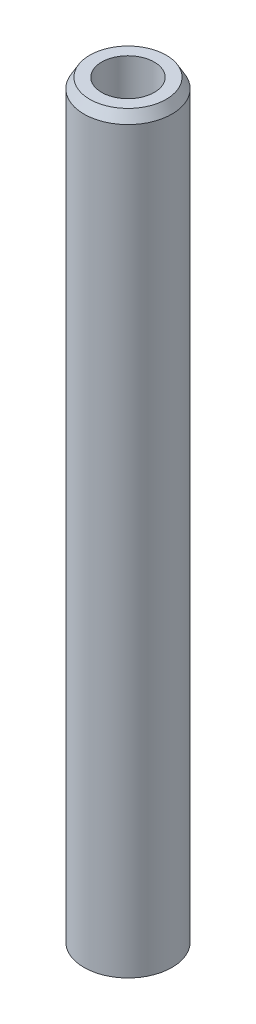
ISO-10303-21;
HEADER;
FILE_DESCRIPTION(('STEP AP214'),'2;1');
FILE_NAME('part.step','',(''),(''),'','','');
FILE_SCHEMA(('AUTOMOTIVE_DESIGN { 1 0 10303 214 1 1 1 1 }'));
ENDSEC;
DATA;
#1=APPLICATION_CONTEXT('core data for automotive mechanical design processes');
#2=APPLICATION_PROTOCOL_DEFINITION('international standard','automotive_design',2000,#1);
#3=PRODUCT_CONTEXT('',#1,'mechanical');
#4=PRODUCT('Part','Part','',(#3));
#5=PRODUCT_RELATED_PRODUCT_CATEGORY('part','',(#4));
#6=PRODUCT_DEFINITION_FORMATION('','',#4);
#7=PRODUCT_DEFINITION_CONTEXT('part definition',#1,'design');
#8=PRODUCT_DEFINITION('design','',#6,#7);
#9=PRODUCT_DEFINITION_SHAPE('','',#8);
#10=(LENGTH_UNIT() NAMED_UNIT(*) SI_UNIT(.MILLI.,.METRE.));
#11=(NAMED_UNIT(*) PLANE_ANGLE_UNIT() SI_UNIT($,.RADIAN.));
#12=(NAMED_UNIT(*) SI_UNIT($,.STERADIAN.) SOLID_ANGLE_UNIT());
#13=UNCERTAINTY_MEASURE_WITH_UNIT(LENGTH_MEASURE(1.E-05),#10,'distance_accuracy_value','');
#14=(GEOMETRIC_REPRESENTATION_CONTEXT(3) GLOBAL_UNCERTAINTY_ASSIGNED_CONTEXT((#13)) GLOBAL_UNIT_ASSIGNED_CONTEXT((#10,
#11,#12)) REPRESENTATION_CONTEXT('',''));
#15=CARTESIAN_POINT('',(0.,0.,0.));
#16=DIRECTION('',(0.,0.,1.));
#17=DIRECTION('',(1.,0.,0.));
#18=AXIS2_PLACEMENT_3D('',#15,#16,#17);
#19=CARTESIAN_POINT('',(0.,428.96692049071,0.));
#20=DIRECTION('',(0.,-1.,0.));
#21=DIRECTION('',(0.,0.,-1.));
#22=AXIS2_PLACEMENT_3D('',#19,#20,#21);
#23=CYLINDRICAL_SURFACE('',#22,25.);
#24=CARTESIAN_POINT('',(0.,423.313227518388,0.));
#25=DIRECTION('',(0.,1.,0.));
#26=DIRECTION('',(0.,0.,1.));
#27=AXIS2_PLACEMENT_3D('',#24,#25,#26);
#28=CIRCLE('',#27,25.);
#29=CARTESIAN_POINT('',(0.,423.313227518388,25.));
#30=VERTEX_POINT('',#29);
#31=EDGE_CURVE('E50',#30,#30,#28,.F.);
#32=ORIENTED_EDGE('',*,*,#31,.T.);
#33=EDGE_LOOP('',(#32));
#34=FACE_BOUND('',#33,.T.);
#35=CARTESIAN_POINT('',(0.,3.2641611594853,0.));
#36=DIRECTION('',(0.,1.,0.));
#37=DIRECTION('',(0.,0.,1.));
#38=AXIS2_PLACEMENT_3D('',#35,#36,#37);
#39=CIRCLE('',#38,25.);
#40=CARTESIAN_POINT('',(0.,3.2641611594853,25.));
#41=VERTEX_POINT('',#40);
#42=EDGE_CURVE('E51',#41,#41,#39,.T.);
#43=ORIENTED_EDGE('',*,*,#42,.T.);
#44=EDGE_LOOP('',(#43));
#45=FACE_BOUND('',#44,.T.);
#46=ADVANCED_FACE('F39',(#34,#45),#23,.T.);
#47=CARTESIAN_POINT('',(0.,428.96692049071,0.));
#48=DIRECTION('',(0.,1.,0.));
#49=DIRECTION('',(0.,0.,1.));
#50=AXIS2_PLACEMENT_3D('',#47,#48,#49);
#51=PLANE('',#50);
#52=CARTESIAN_POINT('',(0.,428.96692049071,0.));
#53=DIRECTION('',(0.,1.,0.));
#54=DIRECTION('',(0.,0.,1.));
#55=AXIS2_PLACEMENT_3D('',#52,#53,#54);
#56=CIRCLE('',#55,21.7358388405148);
#57=CARTESIAN_POINT('',(0.,428.96692049071,21.7358388405148));
#58=VERTEX_POINT('',#57);
#59=EDGE_CURVE('E54',#58,#58,#56,.T.);
#60=ORIENTED_EDGE('',*,*,#59,.T.);
#61=EDGE_LOOP('',(#60));
#62=FACE_BOUND('',#61,.T.);
#63=CARTESIAN_POINT('',(0.,428.96692049071,0.));
#64=DIRECTION('',(0.,1.,0.));
#65=DIRECTION('',(0.,0.,1.));
#66=AXIS2_PLACEMENT_3D('',#63,#64,#65);
#67=CIRCLE('',#66,14.9669292647999);
#68=CARTESIAN_POINT('',(0.,428.96692049071,14.9669292647999));
#69=VERTEX_POINT('',#68);
#70=EDGE_CURVE('E58',#69,#69,#67,.T.);
#71=ORIENTED_EDGE('',*,*,#70,.F.);
#72=EDGE_LOOP('',(#71));
#73=FACE_BOUND('',#72,.T.);
#74=ADVANCED_FACE('F69',(#62,#73),#51,.T.);
#75=CARTESIAN_POINT('',(0.,0.,0.));
#76=DIRECTION('',(0.,1.,0.));
#77=DIRECTION('',(0.,0.,1.));
#78=AXIS2_PLACEMENT_3D('',#75,#76,#77);
#79=PLANE('',#78);
#80=CARTESIAN_POINT('',(0.,0.,0.));
#81=DIRECTION('',(0.,1.,0.));
#82=DIRECTION('',(0.,0.,1.));
#83=AXIS2_PLACEMENT_3D('',#80,#81,#82);
#84=CIRCLE('',#83,19.3463070276784);
#85=CARTESIAN_POINT('',(0.,0.,19.3463070276784));
#86=VERTEX_POINT('',#85);
#87=EDGE_CURVE('E10',#86,#86,#84,.F.);
#88=ORIENTED_EDGE('',*,*,#87,.T.);
#89=EDGE_LOOP('',(#88));
#90=FACE_BOUND('',#89,.T.);
#91=CARTESIAN_POINT('',(0.,0.,0.));
#92=DIRECTION('',(0.,1.,0.));
#93=DIRECTION('',(0.,0.,1.));
#94=AXIS2_PLACEMENT_3D('',#91,#92,#93);
#95=CIRCLE('',#94,14.9669292647999);
#96=CARTESIAN_POINT('',(0.,0.,14.9669292647999));
#97=VERTEX_POINT('',#96);
#98=EDGE_CURVE('E63',#97,#97,#95,.T.);
#99=ORIENTED_EDGE('',*,*,#98,.T.);
#100=EDGE_LOOP('',(#99));
#101=FACE_BOUND('',#100,.T.);
#102=ADVANCED_FACE('F75',(#90,#101),#79,.F.);
#103=CARTESIAN_POINT('',(0.,428.96692049071,0.));
#104=DIRECTION('',(0.,-1.,0.));
#105=DIRECTION('',(0.,0.,-1.));
#106=AXIS2_PLACEMENT_3D('',#103,#104,#105);
#107=CYLINDRICAL_SURFACE('',#106,14.9669292647999);
#108=ORIENTED_EDGE('',*,*,#70,.T.);
#109=EDGE_LOOP('',(#108));
#110=FACE_BOUND('',#109,.T.);
#111=ORIENTED_EDGE('',*,*,#98,.F.);
#112=EDGE_LOOP('',(#111));
#113=FACE_BOUND('',#112,.T.);
#114=ADVANCED_FACE('F70',(#110,#113),#107,.F.);
#115=CARTESIAN_POINT('',(0.,428.96692049071,0.));
#116=DIRECTION('',(0.,-1.,0.));
#117=DIRECTION('',(0.,0.,-1.));
#118=AXIS2_PLACEMENT_3D('',#115,#116,#117);
#119=CONICAL_SURFACE('',#118,21.7358388405148,0.523598775598293);
#120=ORIENTED_EDGE('',*,*,#31,.F.);
#121=EDGE_LOOP('',(#120));
#122=FACE_BOUND('',#121,.T.);
#123=ORIENTED_EDGE('',*,*,#59,.F.);
#124=EDGE_LOOP('',(#123));
#125=FACE_BOUND('',#124,.T.);
#126=ADVANCED_FACE('F81',(#122,#125),#119,.T.);
#127=CARTESIAN_POINT('',(0.,3.2641611594853,0.));
#128=DIRECTION('',(0.,1.,0.));
#129=DIRECTION('',(0.,0.,1.));
#130=AXIS2_PLACEMENT_3D('',#127,#128,#129);
#131=CONICAL_SURFACE('',#130,25.,1.04719755119661);
#132=ORIENTED_EDGE('',*,*,#87,.F.);
#133=EDGE_LOOP('',(#132));
#134=FACE_BOUND('',#133,.T.);
#135=ORIENTED_EDGE('',*,*,#42,.F.);
#136=EDGE_LOOP('',(#135));
#137=FACE_BOUND('',#136,.T.);
#138=ADVANCED_FACE('F45',(#134,#137),#131,.T.);
#139=CLOSED_SHELL('',(#46,#74,#102,#114,#126,#138));
#140=MANIFOLD_SOLID_BREP('B2',#139);
#141=ADVANCED_BREP_SHAPE_REPRESENTATION('',(#18,#140),#14);
#142=SHAPE_DEFINITION_REPRESENTATION(#9,#141);
ENDSEC;
END-ISO-10303-21;
